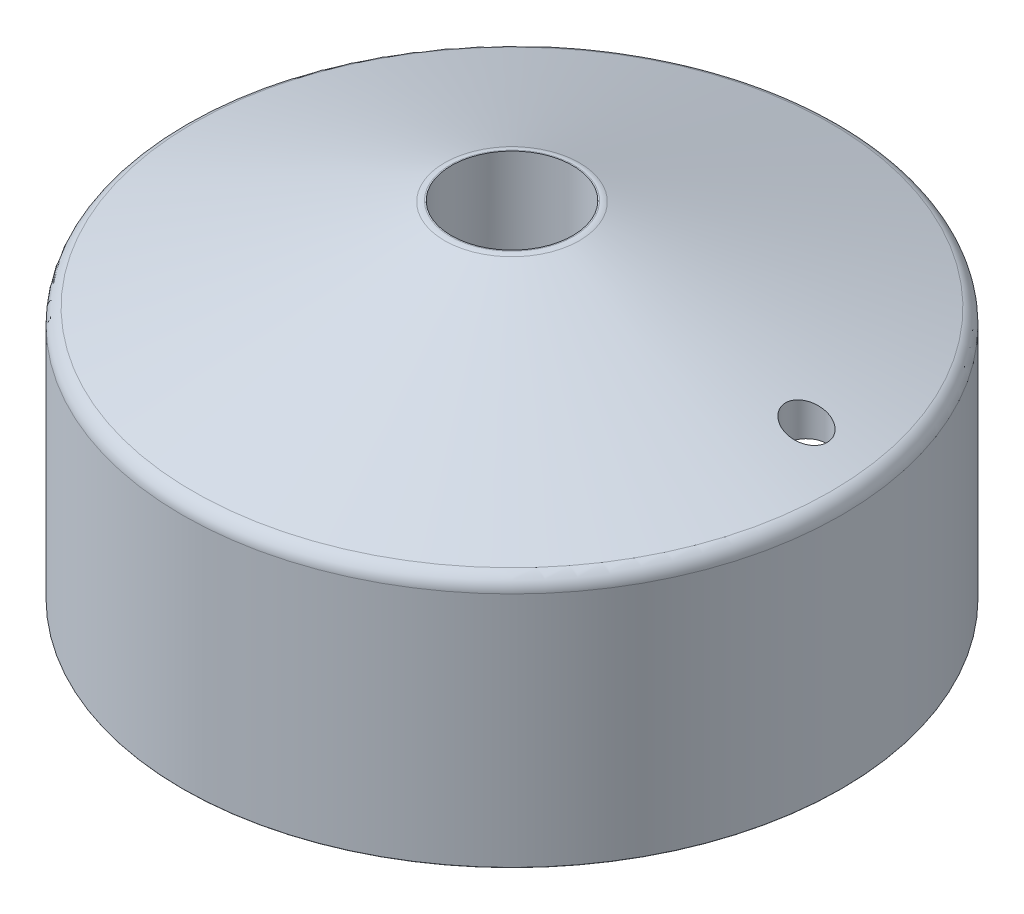
ISO-10303-21;
HEADER;
FILE_DESCRIPTION(('STEP AP214'),'2;1');
FILE_NAME('part.step','',(''),(''),'','','');
FILE_SCHEMA(('AUTOMOTIVE_DESIGN { 1 0 10303 214 1 1 1 1 }'));
ENDSEC;
DATA;
#1=APPLICATION_CONTEXT('core data for automotive mechanical design processes');
#2=APPLICATION_PROTOCOL_DEFINITION('international standard','automotive_design',2000,#1);
#3=PRODUCT_CONTEXT('',#1,'mechanical');
#4=PRODUCT('Part','Part','',(#3));
#5=PRODUCT_RELATED_PRODUCT_CATEGORY('part','',(#4));
#6=PRODUCT_DEFINITION_FORMATION('','',#4);
#7=PRODUCT_DEFINITION_CONTEXT('part definition',#1,'design');
#8=PRODUCT_DEFINITION('design','',#6,#7);
#9=PRODUCT_DEFINITION_SHAPE('','',#8);
#10=(LENGTH_UNIT() NAMED_UNIT(*) SI_UNIT(.MILLI.,.METRE.));
#11=(NAMED_UNIT(*) PLANE_ANGLE_UNIT() SI_UNIT($,.RADIAN.));
#12=(NAMED_UNIT(*) SI_UNIT($,.STERADIAN.) SOLID_ANGLE_UNIT());
#13=UNCERTAINTY_MEASURE_WITH_UNIT(LENGTH_MEASURE(1.E-05),#10,'distance_accuracy_value','');
#14=(GEOMETRIC_REPRESENTATION_CONTEXT(3) GLOBAL_UNCERTAINTY_ASSIGNED_CONTEXT((#13)) GLOBAL_UNIT_ASSIGNED_CONTEXT((#10,
#11,#12)) REPRESENTATION_CONTEXT('',''));
#15=CARTESIAN_POINT('',(0.,0.,0.));
#16=DIRECTION('',(0.,0.,1.));
#17=DIRECTION('',(1.,0.,0.));
#18=AXIS2_PLACEMENT_3D('',#15,#16,#17);
#19=CARTESIAN_POINT('',(10.16,27.0521599294206,0.));
#20=DIRECTION('',(0.,-1.,0.));
#21=DIRECTION('',(1.,0.,0.));
#22=AXIS2_PLACEMENT_3D('',#19,#20,#21);
#23=PLANE('',#22);
#24=CARTESIAN_POINT('',(0.,27.0521599294206,0.));
#25=DIRECTION('',(0.,-1.,0.));
#26=DIRECTION('',(1.,0.,0.));
#27=AXIS2_PLACEMENT_3D('',#24,#25,#26);
#28=CIRCLE('',#27,9.7121294690005);
#29=CARTESIAN_POINT('',(9.7121294690005,27.0521599294206,0.));
#30=VERTEX_POINT('',#29);
#31=EDGE_CURVE('E45',#30,#30,#28,.F.);
#32=ORIENTED_EDGE('',*,*,#31,.T.);
#33=EDGE_LOOP('',(#32));
#34=FACE_BOUND('',#33,.T.);
#35=CARTESIAN_POINT('',(0.,27.0521599294206,0.));
#36=DIRECTION('',(0.,1.,0.));
#37=DIRECTION('',(0.,0.,1.));
#38=AXIS2_PLACEMENT_3D('',#35,#36,#37);
#39=CIRCLE('',#38,9.525);
#40=CARTESIAN_POINT('',(0.,27.0521599294206,9.525));
#41=VERTEX_POINT('',#40);
#42=EDGE_CURVE('E203',#41,#41,#39,.T.);
#43=ORIENTED_EDGE('',*,*,#42,.F.);
#44=EDGE_LOOP('',(#43));
#45=FACE_BOUND('',#44,.T.);
#46=ADVANCED_FACE('F33',(#34,#45),#23,.F.);
#47=CARTESIAN_POINT('',(0.,27.0521599294206,0.));
#48=DIRECTION('',(0.,1.,0.));
#49=DIRECTION('',(-1.,0.,0.));
#50=AXIS2_PLACEMENT_3D('',#47,#48,#49);
#51=CYLINDRICAL_SURFACE('',#50,50.8);
#52=CARTESIAN_POINT('',(0.,-27.0521599294206,0.));
#53=DIRECTION('',(0.,1.,0.));
#54=DIRECTION('',(-1.,0.,0.));
#55=AXIS2_PLACEMENT_3D('',#52,#53,#54);
#56=CIRCLE('',#55,50.8);
#57=CARTESIAN_POINT('',(-50.8,-27.0521599294206,0.));
#58=VERTEX_POINT('',#57);
#59=EDGE_CURVE('E59',#58,#58,#56,.T.);
#60=ORIENTED_EDGE('',*,*,#59,.F.);
#61=EDGE_LOOP('',(#60));
#62=FACE_BOUND('',#61,.T.);
#63=CARTESIAN_POINT('',(0.,11.0478400705794,0.));
#64=DIRECTION('',(0.,1.,0.));
#65=DIRECTION('',(-1.,0.,0.));
#66=AXIS2_PLACEMENT_3D('',#63,#64,#65);
#67=CIRCLE('',#66,50.8);
#68=CARTESIAN_POINT('',(-50.8,11.0478400705794,0.));
#69=VERTEX_POINT('',#68);
#70=EDGE_CURVE('E62',#69,#69,#67,.T.);
#71=ORIENTED_EDGE('',*,*,#70,.T.);
#72=EDGE_LOOP('',(#71));
#73=FACE_BOUND('',#72,.T.);
#74=ADVANCED_FACE('F90',(#62,#73),#51,.F.);
#75=CARTESIAN_POINT('',(50.8,-27.0521599294206,0.));
#76=DIRECTION('',(0.,1.,0.));
#77=DIRECTION('',(-1.,0.,0.));
#78=AXIS2_PLACEMENT_3D('',#75,#76,#77);
#79=PLANE('',#78);
#80=CARTESIAN_POINT('',(0.,-27.0521599294206,0.));
#81=DIRECTION('',(0.,1.,0.));
#82=DIRECTION('',(-1.,0.,0.));
#83=AXIS2_PLACEMENT_3D('',#80,#81,#82);
#84=CIRCLE('',#83,51.6255);
#85=CARTESIAN_POINT('',(-51.6255,-27.0521599294206,0.));
#86=VERTEX_POINT('',#85);
#87=EDGE_CURVE('E10',#86,#86,#84,.F.);
#88=ORIENTED_EDGE('',*,*,#87,.T.);
#89=EDGE_LOOP('',(#88));
#90=FACE_BOUND('',#89,.T.);
#91=ORIENTED_EDGE('',*,*,#59,.T.);
#92=EDGE_LOOP('',(#91));
#93=FACE_BOUND('',#92,.T.);
#94=ADVANCED_FACE('F98',(#90,#93),#79,.F.);
#95=CARTESIAN_POINT('',(0.,27.0521599294206,0.));
#96=DIRECTION('',(0.,1.,0.));
#97=DIRECTION('',(-1.,0.,0.));
#98=AXIS2_PLACEMENT_3D('',#95,#96,#97);
#99=CYLINDRICAL_SURFACE('',#98,51.689);
#100=CARTESIAN_POINT('',(0.,-26.9886599294206,0.));
#101=DIRECTION('',(0.,1.,0.));
#102=DIRECTION('',(-1.,0.,0.));
#103=AXIS2_PLACEMENT_3D('',#100,#101,#102);
#104=CIRCLE('',#103,51.689);
#105=CARTESIAN_POINT('',(-51.689,-26.9886599294206,0.));
#106=VERTEX_POINT('',#105);
#107=EDGE_CURVE('E41',#106,#106,#104,.T.);
#108=ORIENTED_EDGE('',*,*,#107,.T.);
#109=EDGE_LOOP('',(#108));
#110=FACE_BOUND('',#109,.T.);
#111=CARTESIAN_POINT('',(0.,10.1583129235267,0.));
#112=DIRECTION('',(0.,-1.,0.));
#113=DIRECTION('',(1.,0.,0.));
#114=AXIS2_PLACEMENT_3D('',#111,#112,#113);
#115=CIRCLE('',#114,51.689);
#116=CARTESIAN_POINT('',(51.689,10.1583129235267,0.));
#117=VERTEX_POINT('',#116);
#118=EDGE_CURVE('E50',#117,#117,#115,.T.);
#119=ORIENTED_EDGE('',*,*,#118,.T.);
#120=EDGE_LOOP('',(#119));
#121=FACE_BOUND('',#120,.T.);
#122=ADVANCED_FACE('F107',(#110,#121),#99,.T.);
#123=CARTESIAN_POINT('',(0.,11.9368400705794,0.));
#124=DIRECTION('',(0.,-1.,0.));
#125=DIRECTION('',(1.,0.,0.));
#126=AXIS2_PLACEMENT_3D('',#123,#124,#125);
#127=CONICAL_SURFACE('',#126,51.689,1.22173047639603);
#128=CARTESIAN_POINT('',(41.1988898300916,15.4990140309896,-7.64393273052133));
#129=CARTESIAN_POINT('',(41.0135395185152,15.5672570903893,-7.61512733176731));
#130=CARTESIAN_POINT('',(40.8306615268321,15.635710926946,-7.56985847765186));
#131=CARTESIAN_POINT('',(40.4750534816282,15.7710797983913,-7.44746474821687));
#132=CARTESIAN_POINT('',(40.3023373240463,15.8379926533356,-7.37029735862338));
#133=CARTESIAN_POINT('',(39.9721188607416,15.9682399740491,-7.18572252925548));
#134=CARTESIAN_POINT('',(39.8146296212985,16.0315713475292,-7.0782894223237));
#135=CARTESIAN_POINT('',(39.5201556571203,16.1523950653509,-6.83565273527672));
#136=CARTESIAN_POINT('',(39.3831627870668,16.2098897262838,-6.70046023777021));
#137=CARTESIAN_POINT('',(39.1385862495809,16.3150776724883,-6.41035115774755));
#138=CARTESIAN_POINT('',(39.0302022113341,16.3630255958684,-6.25620357425963));
#139=CARTESIAN_POINT('',(38.8415884165597,16.4492553433635,-5.92909220885742));
#140=CARTESIAN_POINT('',(38.7613475385856,16.4875409840808,-5.75613589514291));
#141=CARTESIAN_POINT('',(38.6369823176413,16.550381985004,-5.40865738013518));
#142=CARTESIAN_POINT('',(38.5908142955272,16.5756800050676,-5.23500105619734));
#143=CARTESIAN_POINT('',(38.5284168674039,16.6149473423485,-4.88115964490859));
#144=CARTESIAN_POINT('',(38.5121743381365,16.6289216238702,-4.70097745471702));
#145=CARTESIAN_POINT('',(38.5106342044234,16.6443358432403,-4.35083295291141));
#146=CARTESIAN_POINT('',(38.5235353287094,16.6464786758573,-4.18090730543875));
#147=CARTESIAN_POINT('',(38.5762960696268,16.6400181363502,-3.84552251730565));
#148=CARTESIAN_POINT('',(38.616151430532,16.6314164604638,-3.68006267583999));
#149=CARTESIAN_POINT('',(38.7203423290952,16.6041558484643,-3.36161112623337));
#150=CARTESIAN_POINT('',(38.7841768548752,16.5856996894281,-3.20843726178784));
#151=CARTESIAN_POINT('',(38.9341646925066,16.5396678892398,-2.91495142836373));
#152=CARTESIAN_POINT('',(39.0203201187173,16.5120913840895,-2.77464067955624));
#153=CARTESIAN_POINT('',(39.2149212084407,16.448005298563,-2.50634813340262));
#154=CARTESIAN_POINT('',(39.3239353639277,16.411262168882,-2.37883542938816));
#155=CARTESIAN_POINT('',(39.5592533951794,16.3306553047568,-2.14357158508789));
#156=CARTESIAN_POINT('',(39.6855615595265,16.2867898035979,-2.03582536206638));
#157=CARTESIAN_POINT('',(39.9599931414917,16.1905568815234,-1.83621905540576));
#158=CARTESIAN_POINT('',(40.1089721542923,16.1378365847719,-1.74570606820576));
#159=CARTESIAN_POINT('',(40.4182703191832,16.0276939457718,-1.59066222878036));
#160=CARTESIAN_POINT('',(40.578592872083,15.9702701926,-1.52613920751921));
#161=CARTESIAN_POINT('',(40.9169452778516,15.848588054829,-1.42080454738853));
#162=CARTESIAN_POINT('',(41.0954530984209,15.7841272155142,-1.38175857665493));
#163=CARTESIAN_POINT('',(41.4559350020147,15.6535563770288,-1.3347317401425));
#164=CARTESIAN_POINT('',(41.6379099279299,15.5874459755905,-1.32675852787624));
#165=CARTESIAN_POINT('',(42.007821809579,15.4526976914518,-1.34226184970507));
#166=CARTESIAN_POINT('',(42.195708758182,15.3840636286863,-1.36699909250953));
#167=CARTESIAN_POINT('',(42.5648128266203,15.248795350765,-1.44966579916864));
#168=CARTESIAN_POINT('',(42.7460294341959,15.1821612892748,-1.50759780663335));
#169=CARTESIAN_POINT('',(43.096443502421,15.0527245785848,-1.65553516460181));
#170=CARTESIAN_POINT('',(43.2656378055604,14.9899229365295,-1.74554890390752));
#171=CARTESIAN_POINT('',(43.586457726771,14.8700028923911,-1.95570066283719));
#172=CARTESIAN_POINT('',(43.7380863403501,14.8128835215356,-2.07583353510349));
#173=CARTESIAN_POINT('',(44.0131470586098,14.7080915742352,-2.33829719563017));
#174=CARTESIAN_POINT('',(44.1374145418563,14.6601477589691,-2.47964277158657));
#175=CARTESIAN_POINT('',(44.3599545341848,14.57271936449,-2.78380697267996));
#176=CARTESIAN_POINT('',(44.4582360923878,14.5332318414416,-2.94661809315878));
#177=CARTESIAN_POINT('',(44.6200736646004,14.4660162892724,-3.27930800566112));
#178=CARTESIAN_POINT('',(44.6852614562507,14.4377549976194,-3.44828537414155));
#179=CARTESIAN_POINT('',(44.7861256829612,14.3909457158969,-3.79610583986731));
#180=CARTESIAN_POINT('',(44.8218119529569,14.3723944895359,-3.97494562804784));
#181=CARTESIAN_POINT('',(44.8610393425544,14.3463235888183,-4.32787590763366));
#182=CARTESIAN_POINT('',(44.8660837496218,14.3383034547088,-4.50176349401054));
#183=CARTESIAN_POINT('',(44.8476778641267,14.331896093841,-4.84819202682949));
#184=CARTESIAN_POINT('',(44.8242325429369,14.3335071866547,-5.02073320292924));
#185=CARTESIAN_POINT('',(44.750481946396,14.346153174549,-5.35533153362991));
#186=CARTESIAN_POINT('',(44.7008208525961,14.3569657120742,-5.5175397789902));
#187=CARTESIAN_POINT('',(44.5767187005059,14.3873744534924,-5.83128523927084));
#188=CARTESIAN_POINT('',(44.5022774002496,14.4069707431549,-5.98282234997547));
#189=CARTESIAN_POINT('',(44.3302539375085,14.4545791384253,-6.27266567210042));
#190=CARTESIAN_POINT('',(44.2324560277347,14.4826703985506,-6.4108305625011));
#191=CARTESIAN_POINT('',(44.0172568257999,14.5463780521991,-6.66892247200916));
#192=CARTESIAN_POINT('',(43.8998534933179,14.5819952290411,-6.78884759043308));
#193=CARTESIAN_POINT('',(43.6442051779237,14.6612643750971,-7.0120287623473));
#194=CARTESIAN_POINT('',(43.5053407208547,14.7051689050098,-7.11448463864855));
#195=CARTESIAN_POINT('',(43.2143343973392,14.7988855791724,-7.29498609140599));
#196=CARTESIAN_POINT('',(43.0621862117008,14.8487005391576,-7.37301996827771));
#197=CARTESIAN_POINT('',(42.7403760444795,14.9557884055873,-7.50684752030969));
#198=CARTESIAN_POINT('',(42.5702125460917,15.0133177549637,-7.56122762311613));
#199=CARTESIAN_POINT('',(42.2245687668574,15.1320474324796,-7.64063855230919));
#200=CARTESIAN_POINT('',(42.049093352118,15.1932444482925,-7.66569545327224));
#201=CARTESIAN_POINT('',(41.7604580932098,15.2954591930369,-7.68272479280138));
#202=CARTESIAN_POINT('',(41.6475101381807,15.3358461950266,-7.68333752900553));
#203=CARTESIAN_POINT('',(41.4223742457016,15.4171347997081,-7.67258998933367));
#204=CARTESIAN_POINT('',(41.3101863292754,15.4580364165461,-7.66122938360839));
#205=CARTESIAN_POINT('',(41.1988898300916,15.4990140309896,-7.64393273052133));
#206=B_SPLINE_CURVE_WITH_KNOTS('',3,(#128,#129,#130,#131,#132,#133,#134,#135,#136,#137,#138,
#139,#140,#141,#142,#143,#144,#145,#146,#147,#148,#149,#150,#151,#152,#153,#154,#155,#156,#157,
#158,#159,#160,#161,#162,#163,#164,#165,#166,#167,#168,#169,#170,#171,#172,#173,#174,#175,#176,
#177,#178,#179,#180,#181,#182,#183,#184,#185,#186,#187,#188,#189,#190,#191,#192,#193,#194,#195,
#196,#197,#198,#199,#200,#201,#202,#203,#204,#205),.UNSPECIFIED.,.T.,.F.,(4,2,2,2,2,2,2,2,2,2,2,
2,2,2,2,2,2,2,2,2,2,2,2,2,2,2,2,2,2,2,2,2,2,2,2,2,2,2,4),(0.,0.5983828599842,1.19756582751983,
1.79725847606513,2.39671216830608,2.97699620485722,3.55705066916414,4.09860500689083,
4.63992179963788,5.14870266249627,5.65740321416983,6.15601823091685,6.65468049651776,
7.16764653620994,7.68074001281258,8.22472659212645,8.76887695613381,9.34757783929832,
9.92642125292623,10.528237303667,11.130099475841,11.7321191398619,12.3340359888138,
12.9136929996172,13.4931478888718,14.040266618015,14.587202880309,15.1070745369649,
15.6268554905905,16.1344211280164,16.6419917217084,17.1544456429952,17.6669529282352,
18.1988077460029,18.7309169651022,19.2915004476788,19.8515850723771,20.2108835393831,
20.5701919048312),.UNSPECIFIED.);
#207=CARTESIAN_POINT('',(41.1988898300916,15.4990140309896,-7.64393273052133));
#208=VERTEX_POINT('',#207);
#209=EDGE_CURVE('E65',#208,#208,#206,.T.);
#210=ORIENTED_EDGE('',*,*,#209,.F.);
#211=EDGE_LOOP('',(#210));
#212=FACE_BOUND('',#211,.T.);
#213=CARTESIAN_POINT('',(0.,12.545132180323,0.));
#214=DIRECTION('',(0.,1.,0.));
#215=DIRECTION('',(-1.,0.,0.));
#216=AXIS2_PLACEMENT_3D('',#213,#214,#215);
#217=CIRCLE('',#216,50.0177311640472);
#218=CARTESIAN_POINT('',(-50.0177311640472,12.545132180323,0.));
#219=VERTEX_POINT('',#218);
#220=EDGE_CURVE('E53',#219,#219,#217,.T.);
#221=ORIENTED_EDGE('',*,*,#220,.T.);
#222=EDGE_LOOP('',(#221));
#223=FACE_BOUND('',#222,.T.);
#224=CARTESIAN_POINT('',(0.,26.8989791862168,0.));
#225=DIRECTION('',(0.,1.,0.));
#226=DIRECTION('',(-1.,0.,0.));
#227=AXIS2_PLACEMENT_3D('',#224,#225,#226);
#228=CIRCLE('',#227,10.5808606330477);
#229=CARTESIAN_POINT('',(-10.5808606330477,26.8989791862168,0.));
#230=VERTEX_POINT('',#229);
#231=EDGE_CURVE('E56',#230,#230,#228,.F.);
#232=ORIENTED_EDGE('',*,*,#231,.T.);
#233=EDGE_LOOP('',(#232));
#234=FACE_BOUND('',#233,.T.);
#235=ADVANCED_FACE('F104',(#212,#223,#234),#127,.T.);
#236=CARTESIAN_POINT('',(50.8,11.0478400705794,0.));
#237=DIRECTION('',(0.,1.,0.));
#238=DIRECTION('',(-1.,0.,0.));
#239=AXIS2_PLACEMENT_3D('',#236,#237,#238);
#240=PLANE('',#239);
#241=CARTESIAN_POINT('',(0.,11.0478400705794,0.));
#242=DIRECTION('',(0.,1.,0.));
#243=DIRECTION('',(-1.,0.,0.));
#244=AXIS2_PLACEMENT_3D('',#241,#242,#243);
#245=CIRCLE('',#244,9.52499999999999);
#246=CARTESIAN_POINT('',(-9.52499999999999,11.0478400705794,0.));
#247=VERTEX_POINT('',#246);
#248=EDGE_CURVE('E37',#247,#247,#245,.T.);
#249=ORIENTED_EDGE('',*,*,#248,.T.);
#250=EDGE_LOOP('',(#249));
#251=FACE_BOUND('',#250,.T.);
#252=CARTESIAN_POINT('',(41.6863499634924,11.0478400705794,-4.50657594202168));
#253=DIRECTION('',(0.,1.,0.));
#254=DIRECTION('',(-1.,0.,0.));
#255=AXIS2_PLACEMENT_3D('',#252,#253,#254);
#256=CIRCLE('',#255,3.175);
#257=CARTESIAN_POINT('',(38.5113499634924,11.0478400705794,-4.50657594202168));
#258=VERTEX_POINT('',#257);
#259=EDGE_CURVE('E73',#258,#258,#256,.F.);
#260=ORIENTED_EDGE('',*,*,#259,.F.);
#261=EDGE_LOOP('',(#260));
#262=FACE_BOUND('',#261,.T.);
#263=ORIENTED_EDGE('',*,*,#70,.F.);
#264=EDGE_LOOP('',(#263));
#265=FACE_BOUND('',#264,.T.);
#266=ADVANCED_FACE('F103',(#251,#262,#265),#240,.F.);
#267=CARTESIAN_POINT('',(0.,10.1583129235267,0.));
#268=DIRECTION('',(0.,-1.,0.));
#269=DIRECTION('',(1.,0.,0.));
#270=AXIS2_PLACEMENT_3D('',#267,#268,#269);
#271=TOROIDAL_SURFACE('',#270,49.149,2.54);
#272=ORIENTED_EDGE('',*,*,#118,.F.);
#273=EDGE_LOOP('',(#272));
#274=FACE_BOUND('',#273,.T.);
#275=ORIENTED_EDGE('',*,*,#220,.F.);
#276=EDGE_LOOP('',(#275));
#277=FACE_BOUND('',#276,.T.);
#278=ADVANCED_FACE('F114',(#274,#277),#271,.T.);
#279=CARTESIAN_POINT('',(0.,24.5121599294206,0.));
#280=DIRECTION('',(0.,-1.,0.));
#281=DIRECTION('',(1.,0.,0.));
#282=AXIS2_PLACEMENT_3D('',#279,#280,#281);
#283=TOROIDAL_SURFACE('',#282,9.7121294690005,2.54);
#284=ORIENTED_EDGE('',*,*,#231,.F.);
#285=EDGE_LOOP('',(#284));
#286=FACE_BOUND('',#285,.T.);
#287=ORIENTED_EDGE('',*,*,#31,.F.);
#288=EDGE_LOOP('',(#287));
#289=FACE_BOUND('',#288,.T.);
#290=ADVANCED_FACE('F116',(#286,#289),#283,.T.);
#291=CARTESIAN_POINT('',(0.,-26.9886599294206,0.));
#292=DIRECTION('',(0.,1.,0.));
#293=DIRECTION('',(-1.,0.,0.));
#294=AXIS2_PLACEMENT_3D('',#291,#292,#293);
#295=TOROIDAL_SURFACE('',#294,51.6255,0.0635);
#296=ORIENTED_EDGE('',*,*,#87,.F.);
#297=EDGE_LOOP('',(#296));
#298=FACE_BOUND('',#297,.T.);
#299=ORIENTED_EDGE('',*,*,#107,.F.);
#300=EDGE_LOOP('',(#299));
#301=FACE_BOUND('',#300,.T.);
#302=ADVANCED_FACE('F35',(#298,#301),#295,.T.);
#303=CARTESIAN_POINT('',(41.6863499634922,-27.0531599294212,-4.50657594202168));
#304=DIRECTION('',(0.,1.,0.));
#305=DIRECTION('',(-1.,0.,0.));
#306=AXIS2_PLACEMENT_3D('',#303,#304,#305);
#307=CYLINDRICAL_SURFACE('',#306,3.175);
#308=ORIENTED_EDGE('',*,*,#259,.T.);
#309=EDGE_LOOP('',(#308));
#310=FACE_BOUND('',#309,.T.);
#311=ORIENTED_EDGE('',*,*,#209,.T.);
#312=EDGE_LOOP('',(#311));
#313=FACE_BOUND('',#312,.T.);
#314=ADVANCED_FACE('F75',(#310,#313),#307,.F.);
#315=CARTESIAN_POINT('',(0.,27.0521599294206,0.));
#316=DIRECTION('',(0.,1.,0.));
#317=DIRECTION('',(0.,0.,1.));
#318=AXIS2_PLACEMENT_3D('',#315,#316,#317);
#319=CYLINDRICAL_SURFACE('',#318,9.52499999999999);
#320=ORIENTED_EDGE('',*,*,#42,.T.);
#321=EDGE_LOOP('',(#320));
#322=FACE_BOUND('',#321,.T.);
#323=ORIENTED_EDGE('',*,*,#248,.F.);
#324=EDGE_LOOP('',(#323));
#325=FACE_BOUND('',#324,.T.);
#326=ADVANCED_FACE('F80',(#322,#325),#319,.F.);
#327=CLOSED_SHELL('',(#46,#74,#94,#122,#235,#266,#278,#290,#302,#314,#326));
#328=MANIFOLD_SOLID_BREP('B2',#327);
#329=ADVANCED_BREP_SHAPE_REPRESENTATION('',(#18,#328),#14);
#330=SHAPE_DEFINITION_REPRESENTATION(#9,#329);
ENDSEC;
END-ISO-10303-21;
